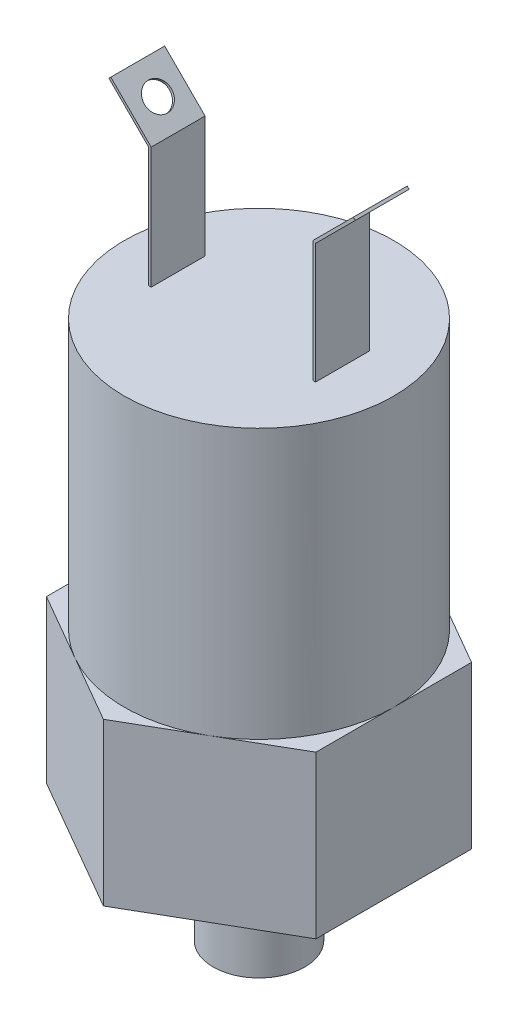
ISO-10303-21;
HEADER;
FILE_DESCRIPTION(('STEP AP214'),'2;1');
FILE_NAME('part.step','',(''),(''),'','','');
FILE_SCHEMA(('AUTOMOTIVE_DESIGN { 1 0 10303 214 1 1 1 1 }'));
ENDSEC;
DATA;
#1=APPLICATION_CONTEXT('core data for automotive mechanical design processes');
#2=APPLICATION_PROTOCOL_DEFINITION('international standard','automotive_design',2000,#1);
#3=PRODUCT_CONTEXT('',#1,'mechanical');
#4=PRODUCT('Part','Part','',(#3));
#5=PRODUCT_RELATED_PRODUCT_CATEGORY('part','',(#4));
#6=PRODUCT_DEFINITION_FORMATION('','',#4);
#7=PRODUCT_DEFINITION_CONTEXT('part definition',#1,'design');
#8=PRODUCT_DEFINITION('design','',#6,#7);
#9=PRODUCT_DEFINITION_SHAPE('','',#8);
#10=(LENGTH_UNIT() NAMED_UNIT(*) SI_UNIT(.MILLI.,.METRE.));
#11=(NAMED_UNIT(*) PLANE_ANGLE_UNIT() SI_UNIT($,.RADIAN.));
#12=(NAMED_UNIT(*) SI_UNIT($,.STERADIAN.) SOLID_ANGLE_UNIT());
#13=UNCERTAINTY_MEASURE_WITH_UNIT(LENGTH_MEASURE(1.E-05),#10,'distance_accuracy_value','');
#14=(GEOMETRIC_REPRESENTATION_CONTEXT(3) GLOBAL_UNCERTAINTY_ASSIGNED_CONTEXT((#13)) GLOBAL_UNIT_ASSIGNED_CONTEXT((#10,
#11,#12)) REPRESENTATION_CONTEXT('',''));
#15=CARTESIAN_POINT('',(0.,0.,0.));
#16=DIRECTION('',(0.,0.,1.));
#17=DIRECTION('',(1.,0.,0.));
#18=AXIS2_PLACEMENT_3D('',#15,#16,#17);
#19=CARTESIAN_POINT('',(0.,50.8,0.));
#20=DIRECTION('',(0.,1.,0.));
#21=DIRECTION('',(0.,0.,1.));
#22=AXIS2_PLACEMENT_3D('',#19,#20,#21);
#23=PLANE('',#22);
#24=CARTESIAN_POINT('',(0.,50.8,0.));
#25=DIRECTION('',(0.,1.,0.));
#26=DIRECTION('',(0.,0.,1.));
#27=AXIS2_PLACEMENT_3D('',#24,#25,#26);
#28=CIRCLE('',#27,12.7);
#29=CARTESIAN_POINT('',(0.,50.8,12.7));
#30=VERTEX_POINT('',#29);
#31=EDGE_CURVE('E283',#30,#30,#28,.T.);
#32=ORIENTED_EDGE('',*,*,#31,.T.);
#33=EDGE_LOOP('',(#32));
#34=FACE_BOUND('',#33,.T.);
#35=DIRECTION('',(0.,0.,-1.));
#36=VECTOR('',#35,1.);
#37=CARTESIAN_POINT('',(7.874,50.8,2.54));
#38=LINE('',#37,#36);
#39=CARTESIAN_POINT('',(7.874,50.8,2.54));
#40=VERTEX_POINT('',#39);
#41=CARTESIAN_POINT('',(7.874,50.8,-2.54));
#42=VERTEX_POINT('',#41);
#43=EDGE_CURVE('E272',#40,#42,#38,.T.);
#44=ORIENTED_EDGE('',*,*,#43,.F.);
#45=DIRECTION('',(-1.,0.,0.));
#46=VECTOR('',#45,1.);
#47=CARTESIAN_POINT('',(7.874,50.8,2.54));
#48=LINE('',#47,#46);
#49=CARTESIAN_POINT('',(7.62,50.8,2.54));
#50=VERTEX_POINT('',#49);
#51=EDGE_CURVE('E250',#40,#50,#48,.T.);
#52=ORIENTED_EDGE('',*,*,#51,.T.);
#53=DIRECTION('',(0.,0.,-1.));
#54=VECTOR('',#53,1.);
#55=CARTESIAN_POINT('',(7.62,50.8,2.54));
#56=LINE('',#55,#54);
#57=CARTESIAN_POINT('',(7.62,50.8,-2.54));
#58=VERTEX_POINT('',#57);
#59=EDGE_CURVE('E275',#50,#58,#56,.T.);
#60=ORIENTED_EDGE('',*,*,#59,.T.);
#61=DIRECTION('',(-1.,0.,0.));
#62=VECTOR('',#61,1.);
#63=CARTESIAN_POINT('',(7.874,50.8,-2.54));
#64=LINE('',#63,#62);
#65=EDGE_CURVE('E266',#42,#58,#64,.T.);
#66=ORIENTED_EDGE('',*,*,#65,.F.);
#67=EDGE_LOOP('',(#44,#52,#60,#66));
#68=FACE_BOUND('',#67,.T.);
#69=DIRECTION('',(0.,0.,-1.));
#70=VECTOR('',#69,1.);
#71=CARTESIAN_POINT('',(-7.62,50.8,2.54));
#72=LINE('',#71,#70);
#73=CARTESIAN_POINT('',(-7.62,50.8,2.54));
#74=VERTEX_POINT('',#73);
#75=CARTESIAN_POINT('',(-7.62,50.8,-2.54));
#76=VERTEX_POINT('',#75);
#77=EDGE_CURVE('E57',#74,#76,#72,.T.);
#78=ORIENTED_EDGE('',*,*,#77,.F.);
#79=DIRECTION('',(1.,0.,0.));
#80=VECTOR('',#79,1.);
#81=CARTESIAN_POINT('',(-7.874,50.8,2.54));
#82=LINE('',#81,#80);
#83=CARTESIAN_POINT('',(-7.874,50.8,2.54));
#84=VERTEX_POINT('',#83);
#85=EDGE_CURVE('E52',#84,#74,#82,.T.);
#86=ORIENTED_EDGE('',*,*,#85,.F.);
#87=DIRECTION('',(0.,0.,-1.));
#88=VECTOR('',#87,1.);
#89=CARTESIAN_POINT('',(-7.874,50.8,2.54));
#90=LINE('',#89,#88);
#91=CARTESIAN_POINT('',(-7.874,50.8,-2.54));
#92=VERTEX_POINT('',#91);
#93=EDGE_CURVE('E189',#84,#92,#90,.T.);
#94=ORIENTED_EDGE('',*,*,#93,.T.);
#95=DIRECTION('',(1.,0.,0.));
#96=VECTOR('',#95,1.);
#97=CARTESIAN_POINT('',(-7.874,50.8,-2.54));
#98=LINE('',#97,#96);
#99=EDGE_CURVE('E215',#92,#76,#98,.T.);
#100=ORIENTED_EDGE('',*,*,#99,.T.);
#101=EDGE_LOOP('',(#78,#86,#94,#100));
#102=FACE_BOUND('',#101,.T.);
#103=ADVANCED_FACE('F34',(#34,#68,#102),#23,.T.);
#104=CARTESIAN_POINT('',(0.,25.4,0.));
#105=DIRECTION('',(0.,1.,0.));
#106=DIRECTION('',(0.,0.,1.));
#107=AXIS2_PLACEMENT_3D('',#104,#105,#106);
#108=PLANE('',#107);
#109=CARTESIAN_POINT('',(0.,25.4,0.));
#110=DIRECTION('',(0.,1.,0.));
#111=DIRECTION('',(0.,0.,1.));
#112=AXIS2_PLACEMENT_3D('',#109,#110,#111);
#113=CIRCLE('',#112,12.7);
#114=CARTESIAN_POINT('',(6.35,25.4,10.9985226280624));
#115=VERTEX_POINT('',#114);
#116=CARTESIAN_POINT('',(12.7,25.4,0.));
#117=VERTEX_POINT('',#116);
#118=EDGE_CURVE('E45',#115,#117,#113,.T.);
#119=ORIENTED_EDGE('',*,*,#118,.F.);
#120=DIRECTION('',(0.866025403784439,0.,-0.5));
#121=VECTOR('',#120,1.);
#122=CARTESIAN_POINT('',(0.,25.4,14.6646968374165));
#123=LINE('',#122,#121);
#124=CARTESIAN_POINT('',(12.7,25.4,7.33234841870824));
#125=VERTEX_POINT('',#124);
#126=EDGE_CURVE('E305',#115,#125,#123,.T.);
#127=ORIENTED_EDGE('',*,*,#126,.T.);
#128=DIRECTION('',(0.,0.,-1.));
#129=VECTOR('',#128,1.);
#130=CARTESIAN_POINT('',(12.7,25.4,7.33234841870824));
#131=LINE('',#130,#129);
#132=EDGE_CURVE('E309',#125,#117,#131,.T.);
#133=ORIENTED_EDGE('',*,*,#132,.T.);
#134=EDGE_LOOP('',(#119,#127,#133));
#135=FACE_BOUND('',#134,.T.);
#136=ADVANCED_FACE('F364',(#135),#108,.T.);
#137=CARTESIAN_POINT('',(6.35,25.4,-10.9985226280624));
#138=VERTEX_POINT('',#137);
#139=EDGE_CURVE('E11',#117,#138,#113,.T.);
#140=ORIENTED_EDGE('',*,*,#139,.F.);
#141=CARTESIAN_POINT('',(12.7,25.4,-7.33234841870825));
#142=VERTEX_POINT('',#141);
#143=EDGE_CURVE('E308',#117,#142,#131,.T.);
#144=ORIENTED_EDGE('',*,*,#143,.T.);
#145=DIRECTION('',(-0.866025403784439,0.,-0.5));
#146=VECTOR('',#145,1.);
#147=CARTESIAN_POINT('',(12.7,25.4,-7.33234841870825));
#148=LINE('',#147,#146);
#149=EDGE_CURVE('E289',#142,#138,#148,.T.);
#150=ORIENTED_EDGE('',*,*,#149,.T.);
#151=EDGE_LOOP('',(#140,#144,#150));
#152=FACE_BOUND('',#151,.T.);
#153=ADVANCED_FACE('F370',(#152),#108,.T.);
#154=CARTESIAN_POINT('',(-6.35,25.4,-10.9985226280624));
#155=VERTEX_POINT('',#154);
#156=EDGE_CURVE('E43',#138,#155,#113,.T.);
#157=ORIENTED_EDGE('',*,*,#156,.F.);
#158=CARTESIAN_POINT('',(0.,25.4,-14.6646968374165));
#159=VERTEX_POINT('',#158);
#160=EDGE_CURVE('E293',#138,#159,#148,.T.);
#161=ORIENTED_EDGE('',*,*,#160,.T.);
#162=DIRECTION('',(-0.866025403784438,0.,0.5));
#163=VECTOR('',#162,1.);
#164=CARTESIAN_POINT('',(0.,25.4,-14.6646968374165));
#165=LINE('',#164,#163);
#166=EDGE_CURVE('E294',#159,#155,#165,.T.);
#167=ORIENTED_EDGE('',*,*,#166,.T.);
#168=EDGE_LOOP('',(#157,#161,#167));
#169=FACE_BOUND('',#168,.T.);
#170=ADVANCED_FACE('F436',(#169),#108,.T.);
#171=CARTESIAN_POINT('',(-12.7,25.4,0.));
#172=VERTEX_POINT('',#171);
#173=EDGE_CURVE('E433',#155,#172,#113,.T.);
#174=ORIENTED_EDGE('',*,*,#173,.F.);
#175=CARTESIAN_POINT('',(-12.7,25.4,-7.33234841870824));
#176=VERTEX_POINT('',#175);
#177=EDGE_CURVE('E292',#155,#176,#165,.T.);
#178=ORIENTED_EDGE('',*,*,#177,.T.);
#179=DIRECTION('',(0.,0.,1.));
#180=VECTOR('',#179,1.);
#181=CARTESIAN_POINT('',(-12.7,25.4,-7.33234841870824));
#182=LINE('',#181,#180);
#183=EDGE_CURVE('E298',#176,#172,#182,.T.);
#184=ORIENTED_EDGE('',*,*,#183,.T.);
#185=EDGE_LOOP('',(#174,#178,#184));
#186=FACE_BOUND('',#185,.T.);
#187=ADVANCED_FACE('F446',(#186),#108,.T.);
#188=CARTESIAN_POINT('',(-6.35,25.4,10.9985226280624));
#189=VERTEX_POINT('',#188);
#190=EDGE_CURVE('E346',#172,#189,#113,.T.);
#191=ORIENTED_EDGE('',*,*,#190,.F.);
#192=CARTESIAN_POINT('',(-12.7,25.4,7.33234841870825));
#193=VERTEX_POINT('',#192);
#194=EDGE_CURVE('E297',#172,#193,#182,.T.);
#195=ORIENTED_EDGE('',*,*,#194,.T.);
#196=DIRECTION('',(0.866025403784439,0.,0.5));
#197=VECTOR('',#196,1.);
#198=CARTESIAN_POINT('',(-12.7,25.4,7.33234841870825));
#199=LINE('',#198,#197);
#200=EDGE_CURVE('E302',#193,#189,#199,.T.);
#201=ORIENTED_EDGE('',*,*,#200,.T.);
#202=EDGE_LOOP('',(#191,#195,#201));
#203=FACE_BOUND('',#202,.T.);
#204=ADVANCED_FACE('F361',(#203),#108,.T.);
#205=CARTESIAN_POINT('',(0.,10.16,0.));
#206=DIRECTION('',(0.,-1.,0.));
#207=DIRECTION('',(0.,0.,-1.));
#208=AXIS2_PLACEMENT_3D('',#205,#206,#207);
#209=CYLINDRICAL_SURFACE('',#208,4.318);
#210=CARTESIAN_POINT('',(0.,10.16,0.));
#211=DIRECTION('',(0.,1.,0.));
#212=DIRECTION('',(0.,0.,1.));
#213=AXIS2_PLACEMENT_3D('',#210,#211,#212);
#214=CIRCLE('',#213,4.318);
#215=CARTESIAN_POINT('',(0.,10.16,4.318));
#216=VERTEX_POINT('',#215);
#217=EDGE_CURVE('E341',#216,#216,#214,.T.);
#218=ORIENTED_EDGE('',*,*,#217,.F.);
#219=EDGE_LOOP('',(#218));
#220=FACE_BOUND('',#219,.T.);
#221=CARTESIAN_POINT('',(0.,0.,0.));
#222=DIRECTION('',(0.,1.,0.));
#223=DIRECTION('',(0.,0.,1.));
#224=AXIS2_PLACEMENT_3D('',#221,#222,#223);
#225=CIRCLE('',#224,4.318);
#226=CARTESIAN_POINT('',(0.,0.,4.318));
#227=VERTEX_POINT('',#226);
#228=EDGE_CURVE('E38',#227,#227,#225,.T.);
#229=ORIENTED_EDGE('',*,*,#228,.T.);
#230=EDGE_LOOP('',(#229));
#231=FACE_BOUND('',#230,.T.);
#232=ADVANCED_FACE('F36',(#220,#231),#209,.T.);
#233=CARTESIAN_POINT('',(0.,0.,0.));
#234=DIRECTION('',(0.,1.,0.));
#235=DIRECTION('',(0.,0.,1.));
#236=AXIS2_PLACEMENT_3D('',#233,#234,#235);
#237=PLANE('',#236);
#238=ORIENTED_EDGE('',*,*,#228,.F.);
#239=EDGE_LOOP('',(#238));
#240=FACE_BOUND('',#239,.T.);
#241=ADVANCED_FACE('F351',(#240),#237,.F.);
#242=CARTESIAN_POINT('',(12.7,25.4,-7.33234841870825));
#243=DIRECTION('',(-0.5,0.,0.866025403784439));
#244=DIRECTION('',(0.866025403784439,0.,0.5));
#245=AXIS2_PLACEMENT_3D('',#242,#243,#244);
#246=PLANE('',#245);
#247=DIRECTION('',(-0.866025403784439,0.,-0.5));
#248=VECTOR('',#247,1.);
#249=CARTESIAN_POINT('',(12.7,10.16,-7.33234841870825));
#250=LINE('',#249,#248);
#251=CARTESIAN_POINT('',(12.7,10.16,-7.33234841870825));
#252=VERTEX_POINT('',#251);
#253=CARTESIAN_POINT('',(0.,10.16,-14.6646968374165));
#254=VERTEX_POINT('',#253);
#255=EDGE_CURVE('E285',#252,#254,#250,.T.);
#256=ORIENTED_EDGE('',*,*,#255,.T.);
#257=DIRECTION('',(0.,-1.,0.));
#258=VECTOR('',#257,1.);
#259=CARTESIAN_POINT('',(0.,25.4,-14.6646968374165));
#260=LINE('',#259,#258);
#261=EDGE_CURVE('E339',#159,#254,#260,.T.);
#262=ORIENTED_EDGE('',*,*,#261,.F.);
#263=ORIENTED_EDGE('',*,*,#160,.F.);
#264=ORIENTED_EDGE('',*,*,#149,.F.);
#265=DIRECTION('',(0.,-1.,0.));
#266=VECTOR('',#265,1.);
#267=CARTESIAN_POINT('',(12.7,25.4,-7.33234841870825));
#268=LINE('',#267,#266);
#269=EDGE_CURVE('E312',#142,#252,#268,.T.);
#270=ORIENTED_EDGE('',*,*,#269,.T.);
#271=EDGE_LOOP('',(#256,#262,#263,#264,#270));
#272=FACE_BOUND('',#271,.T.);
#273=ADVANCED_FACE('F353',(#272),#246,.F.);
#274=CARTESIAN_POINT('',(0.,25.4,-14.6646968374165));
#275=DIRECTION('',(0.5,0.,0.866025403784438));
#276=DIRECTION('',(0.866025403784439,0.,-0.5));
#277=AXIS2_PLACEMENT_3D('',#274,#275,#276);
#278=PLANE('',#277);
#279=DIRECTION('',(-0.866025403784438,0.,0.5));
#280=VECTOR('',#279,1.);
#281=CARTESIAN_POINT('',(0.,10.16,-14.6646968374165));
#282=LINE('',#281,#280);
#283=CARTESIAN_POINT('',(-12.7,10.16,-7.33234841870824));
#284=VERTEX_POINT('',#283);
#285=EDGE_CURVE('E315',#254,#284,#282,.T.);
#286=ORIENTED_EDGE('',*,*,#285,.T.);
#287=DIRECTION('',(0.,-1.,0.));
#288=VECTOR('',#287,1.);
#289=CARTESIAN_POINT('',(-12.7,25.4,-7.33234841870824));
#290=LINE('',#289,#288);
#291=EDGE_CURVE('E336',#176,#284,#290,.T.);
#292=ORIENTED_EDGE('',*,*,#291,.F.);
#293=ORIENTED_EDGE('',*,*,#177,.F.);
#294=ORIENTED_EDGE('',*,*,#166,.F.);
#295=ORIENTED_EDGE('',*,*,#261,.T.);
#296=EDGE_LOOP('',(#286,#292,#293,#294,#295));
#297=FACE_BOUND('',#296,.T.);
#298=ADVANCED_FACE('F358',(#297),#278,.F.);
#299=CARTESIAN_POINT('',(-12.7,25.4,-7.33234841870824));
#300=DIRECTION('',(1.,0.,0.));
#301=DIRECTION('',(0.,0.,-1.));
#302=AXIS2_PLACEMENT_3D('',#299,#300,#301);
#303=PLANE('',#302);
#304=DIRECTION('',(0.,0.,1.));
#305=VECTOR('',#304,1.);
#306=CARTESIAN_POINT('',(-12.7,10.16,-7.33234841870824));
#307=LINE('',#306,#305);
#308=CARTESIAN_POINT('',(-12.7,10.16,7.33234841870825));
#309=VERTEX_POINT('',#308);
#310=EDGE_CURVE('E317',#284,#309,#307,.T.);
#311=ORIENTED_EDGE('',*,*,#310,.T.);
#312=DIRECTION('',(0.,-1.,0.));
#313=VECTOR('',#312,1.);
#314=CARTESIAN_POINT('',(-12.7,25.4,7.33234841870825));
#315=LINE('',#314,#313);
#316=EDGE_CURVE('E333',#193,#309,#315,.T.);
#317=ORIENTED_EDGE('',*,*,#316,.F.);
#318=ORIENTED_EDGE('',*,*,#194,.F.);
#319=ORIENTED_EDGE('',*,*,#183,.F.);
#320=ORIENTED_EDGE('',*,*,#291,.T.);
#321=EDGE_LOOP('',(#311,#317,#318,#319,#320));
#322=FACE_BOUND('',#321,.T.);
#323=ADVANCED_FACE('F399',(#322),#303,.F.);
#324=CARTESIAN_POINT('',(-12.7,25.4,7.33234841870825));
#325=DIRECTION('',(0.5,0.,-0.866025403784439));
#326=DIRECTION('',(-0.866025403784439,0.,-0.5));
#327=AXIS2_PLACEMENT_3D('',#324,#325,#326);
#328=PLANE('',#327);
#329=DIRECTION('',(0.866025403784439,0.,0.5));
#330=VECTOR('',#329,1.);
#331=CARTESIAN_POINT('',(-12.7,10.16,7.33234841870825));
#332=LINE('',#331,#330);
#333=CARTESIAN_POINT('',(0.,10.16,14.6646968374165));
#334=VERTEX_POINT('',#333);
#335=EDGE_CURVE('E319',#309,#334,#332,.T.);
#336=ORIENTED_EDGE('',*,*,#335,.T.);
#337=DIRECTION('',(0.,-1.,0.));
#338=VECTOR('',#337,1.);
#339=CARTESIAN_POINT('',(0.,25.4,14.6646968374165));
#340=LINE('',#339,#338);
#341=CARTESIAN_POINT('',(0.,25.4,14.6646968374165));
#342=VERTEX_POINT('',#341);
#343=EDGE_CURVE('E330',#342,#334,#340,.T.);
#344=ORIENTED_EDGE('',*,*,#343,.F.);
#345=EDGE_CURVE('E301',#189,#342,#199,.T.);
#346=ORIENTED_EDGE('',*,*,#345,.F.);
#347=ORIENTED_EDGE('',*,*,#200,.F.);
#348=ORIENTED_EDGE('',*,*,#316,.T.);
#349=EDGE_LOOP('',(#336,#344,#346,#347,#348));
#350=FACE_BOUND('',#349,.T.);
#351=ADVANCED_FACE('F395',(#350),#328,.F.);
#352=CARTESIAN_POINT('',(0.,25.4,14.6646968374165));
#353=DIRECTION('',(-0.5,0.,-0.866025403784439));
#354=DIRECTION('',(-0.866025403784439,0.,0.5));
#355=AXIS2_PLACEMENT_3D('',#352,#353,#354);
#356=PLANE('',#355);
#357=DIRECTION('',(0.866025403784439,0.,-0.5));
#358=VECTOR('',#357,1.);
#359=CARTESIAN_POINT('',(0.,10.16,14.6646968374165));
#360=LINE('',#359,#358);
#361=CARTESIAN_POINT('',(12.7,10.16,7.33234841870824));
#362=VERTEX_POINT('',#361);
#363=EDGE_CURVE('E321',#334,#362,#360,.T.);
#364=ORIENTED_EDGE('',*,*,#363,.T.);
#365=DIRECTION('',(0.,-1.,0.));
#366=VECTOR('',#365,1.);
#367=CARTESIAN_POINT('',(12.7,25.4,7.33234841870824));
#368=LINE('',#367,#366);
#369=EDGE_CURVE('E327',#125,#362,#368,.T.);
#370=ORIENTED_EDGE('',*,*,#369,.F.);
#371=ORIENTED_EDGE('',*,*,#126,.F.);
#372=EDGE_CURVE('E306',#342,#115,#123,.T.);
#373=ORIENTED_EDGE('',*,*,#372,.F.);
#374=ORIENTED_EDGE('',*,*,#343,.T.);
#375=EDGE_LOOP('',(#364,#370,#371,#373,#374));
#376=FACE_BOUND('',#375,.T.);
#377=ADVANCED_FACE('F391',(#376),#356,.F.);
#378=CARTESIAN_POINT('',(12.7,25.4,7.33234841870824));
#379=DIRECTION('',(-1.,0.,0.));
#380=DIRECTION('',(0.,0.,1.));
#381=AXIS2_PLACEMENT_3D('',#378,#379,#380);
#382=PLANE('',#381);
#383=DIRECTION('',(0.,0.,-1.));
#384=VECTOR('',#383,1.);
#385=CARTESIAN_POINT('',(12.7,10.16,7.33234841870824));
#386=LINE('',#385,#384);
#387=EDGE_CURVE('E323',#362,#252,#386,.T.);
#388=ORIENTED_EDGE('',*,*,#387,.T.);
#389=ORIENTED_EDGE('',*,*,#269,.F.);
#390=ORIENTED_EDGE('',*,*,#143,.F.);
#391=ORIENTED_EDGE('',*,*,#132,.F.);
#392=ORIENTED_EDGE('',*,*,#369,.T.);
#393=EDGE_LOOP('',(#388,#389,#390,#391,#392));
#394=FACE_BOUND('',#393,.T.);
#395=ADVANCED_FACE('F385',(#394),#382,.F.);
#396=EDGE_CURVE('E288',#189,#115,#113,.T.);
#397=ORIENTED_EDGE('',*,*,#396,.F.);
#398=ORIENTED_EDGE('',*,*,#345,.T.);
#399=ORIENTED_EDGE('',*,*,#372,.T.);
#400=EDGE_LOOP('',(#397,#398,#399));
#401=FACE_BOUND('',#400,.T.);
#402=ADVANCED_FACE('F373',(#401),#108,.T.);
#403=CARTESIAN_POINT('',(0.,10.16,0.));
#404=DIRECTION('',(0.,1.,0.));
#405=DIRECTION('',(0.,0.,1.));
#406=AXIS2_PLACEMENT_3D('',#403,#404,#405);
#407=PLANE('',#406);
#408=ORIENTED_EDGE('',*,*,#217,.T.);
#409=EDGE_LOOP('',(#408));
#410=FACE_BOUND('',#409,.T.);
#411=ORIENTED_EDGE('',*,*,#255,.F.);
#412=ORIENTED_EDGE('',*,*,#387,.F.);
#413=ORIENTED_EDGE('',*,*,#363,.F.);
#414=ORIENTED_EDGE('',*,*,#335,.F.);
#415=ORIENTED_EDGE('',*,*,#310,.F.);
#416=ORIENTED_EDGE('',*,*,#285,.F.);
#417=EDGE_LOOP('',(#411,#412,#413,#414,#415,#416));
#418=FACE_BOUND('',#417,.T.);
#419=ADVANCED_FACE('F381',(#410,#418),#407,.F.);
#420=CARTESIAN_POINT('',(0.,50.8,0.));
#421=DIRECTION('',(0.,-1.,0.));
#422=DIRECTION('',(0.,0.,-1.));
#423=AXIS2_PLACEMENT_3D('',#420,#421,#422);
#424=CYLINDRICAL_SURFACE('',#423,12.7);
#425=ORIENTED_EDGE('',*,*,#31,.F.);
#426=EDGE_LOOP('',(#425));
#427=FACE_BOUND('',#426,.T.);
#428=ORIENTED_EDGE('',*,*,#118,.T.);
#429=ORIENTED_EDGE('',*,*,#139,.T.);
#430=ORIENTED_EDGE('',*,*,#156,.T.);
#431=ORIENTED_EDGE('',*,*,#173,.T.);
#432=ORIENTED_EDGE('',*,*,#190,.T.);
#433=ORIENTED_EDGE('',*,*,#396,.T.);
#434=EDGE_LOOP('',(#428,#429,#430,#431,#432,#433));
#435=FACE_BOUND('',#434,.T.);
#436=ADVANCED_FACE('F379',(#427,#435),#424,.T.);
#437=CARTESIAN_POINT('',(7.79960512242138,62.0503948775786,2.54));
#438=DIRECTION('',(-0.707106781186545,0.70710678118655,0.));
#439=DIRECTION('',(-0.70710678118655,-0.707106781186545,0.));
#440=AXIS2_PLACEMENT_3D('',#437,#438,#439);
#441=PLANE('',#440);
#442=CARTESIAN_POINT('',(9.70460512242139,63.9553948775786,0.));
#443=DIRECTION('',(-0.707106781186545,0.70710678118655,0.));
#444=DIRECTION('',(-0.70710678118655,-0.707106781186545,0.));
#445=AXIS2_PLACEMENT_3D('',#442,#443,#444);
#446=CIRCLE('',#445,1.27);
#447=CARTESIAN_POINT('',(8.80657951031447,63.0573692654717,0.));
#448=VERTEX_POINT('',#447);
#449=EDGE_CURVE('E234',#448,#448,#446,.F.);
#450=ORIENTED_EDGE('',*,*,#449,.F.);
#451=EDGE_LOOP('',(#450));
#452=FACE_BOUND('',#451,.T.);
#453=DIRECTION('',(0.70710678118655,0.707106781186545,0.));
#454=VECTOR('',#453,1.);
#455=CARTESIAN_POINT('',(7.79960512242138,62.0503948775786,-2.54));
#456=LINE('',#455,#454);
#457=CARTESIAN_POINT('',(7.874,62.1247897551572,-2.54));
#458=VERTEX_POINT('',#457);
#459=CARTESIAN_POINT('',(11.6096051224214,65.8603948775786,-2.54));
#460=VERTEX_POINT('',#459);
#461=EDGE_CURVE('E237',#458,#460,#456,.T.);
#462=ORIENTED_EDGE('',*,*,#461,.T.);
#463=DIRECTION('',(0.,0.,-1.));
#464=VECTOR('',#463,1.);
#465=CARTESIAN_POINT('',(11.6096051224214,65.8603948775786,2.54));
#466=LINE('',#465,#464);
#467=CARTESIAN_POINT('',(11.6096051224214,65.8603948775786,2.54));
#468=VERTEX_POINT('',#467);
#469=EDGE_CURVE('E281',#468,#460,#466,.T.);
#470=ORIENTED_EDGE('',*,*,#469,.F.);
#471=DIRECTION('',(0.70710678118655,0.707106781186545,0.));
#472=VECTOR('',#471,1.);
#473=CARTESIAN_POINT('',(7.79960512242138,62.0503948775786,2.54));
#474=LINE('',#473,#472);
#475=CARTESIAN_POINT('',(7.874,62.1247897551572,2.54));
#476=VERTEX_POINT('',#475);
#477=EDGE_CURVE('E238',#476,#468,#474,.T.);
#478=ORIENTED_EDGE('',*,*,#477,.F.);
#479=DIRECTION('',(0.,0.,-1.));
#480=VECTOR('',#479,1.);
#481=CARTESIAN_POINT('',(7.874,62.1247897551572,2.54));
#482=LINE('',#481,#480);
#483=EDGE_CURVE('E254',#476,#458,#482,.T.);
#484=ORIENTED_EDGE('',*,*,#483,.T.);
#485=EDGE_LOOP('',(#462,#470,#478,#484));
#486=FACE_BOUND('',#485,.T.);
#487=ADVANCED_FACE('F377',(#452,#486),#441,.F.);
#488=CARTESIAN_POINT('',(11.43,66.04,2.54));
#489=DIRECTION('',(0.707106781186537,0.707106781186558,0.));
#490=DIRECTION('',(-0.707106781186558,0.707106781186537,0.));
#491=AXIS2_PLACEMENT_3D('',#488,#489,#490);
#492=PLANE('',#491);
#493=DIRECTION('',(0.707106781186558,-0.707106781186537,0.));
#494=VECTOR('',#493,1.);
#495=CARTESIAN_POINT('',(11.43,66.04,-2.54));
#496=LINE('',#495,#494);
#497=CARTESIAN_POINT('',(11.43,66.04,-2.54));
#498=VERTEX_POINT('',#497);
#499=EDGE_CURVE('E257',#498,#460,#496,.T.);
#500=ORIENTED_EDGE('',*,*,#499,.F.);
#501=DIRECTION('',(0.,0.,-1.));
#502=VECTOR('',#501,1.);
#503=CARTESIAN_POINT('',(11.43,66.04,2.54));
#504=LINE('',#503,#502);
#505=CARTESIAN_POINT('',(11.43,66.04,2.54));
#506=VERTEX_POINT('',#505);
#507=EDGE_CURVE('E279',#506,#498,#504,.T.);
#508=ORIENTED_EDGE('',*,*,#507,.F.);
#509=DIRECTION('',(0.707106781186558,-0.707106781186537,0.));
#510=VECTOR('',#509,1.);
#511=CARTESIAN_POINT('',(11.43,66.04,2.54));
#512=LINE('',#511,#510);
#513=EDGE_CURVE('E240',#506,#468,#512,.T.);
#514=ORIENTED_EDGE('',*,*,#513,.T.);
#515=ORIENTED_EDGE('',*,*,#469,.T.);
#516=EDGE_LOOP('',(#500,#508,#514,#515));
#517=FACE_BOUND('',#516,.T.);
#518=ADVANCED_FACE('F573',(#517),#492,.T.);
#519=CARTESIAN_POINT('',(7.62,62.23,2.54));
#520=DIRECTION('',(-0.707106781186545,0.70710678118655,0.));
#521=DIRECTION('',(-0.70710678118655,-0.707106781186545,0.));
#522=AXIS2_PLACEMENT_3D('',#519,#520,#521);
#523=PLANE('',#522);
#524=CARTESIAN_POINT('',(9.525,64.135,0.));
#525=DIRECTION('',(-0.707106781186545,0.70710678118655,0.));
#526=DIRECTION('',(-0.70710678118655,-0.707106781186545,0.));
#527=AXIS2_PLACEMENT_3D('',#524,#525,#526);
#528=CIRCLE('',#527,1.27);
#529=CARTESIAN_POINT('',(8.62697438789309,63.2369743878931,0.));
#530=VERTEX_POINT('',#529);
#531=EDGE_CURVE('E188',#530,#530,#528,.T.);
#532=ORIENTED_EDGE('',*,*,#531,.F.);
#533=EDGE_LOOP('',(#532));
#534=FACE_BOUND('',#533,.T.);
#535=DIRECTION('',(0.70710678118655,0.707106781186545,0.));
#536=VECTOR('',#535,1.);
#537=CARTESIAN_POINT('',(7.62,62.23,-2.54));
#538=LINE('',#537,#536);
#539=CARTESIAN_POINT('',(7.62,62.23,-2.54));
#540=VERTEX_POINT('',#539);
#541=EDGE_CURVE('E260',#540,#498,#538,.T.);
#542=ORIENTED_EDGE('',*,*,#541,.F.);
#543=DIRECTION('',(0.,0.,-1.));
#544=VECTOR('',#543,1.);
#545=CARTESIAN_POINT('',(7.62,62.23,2.54));
#546=LINE('',#545,#544);
#547=CARTESIAN_POINT('',(7.62,62.23,2.54));
#548=VERTEX_POINT('',#547);
#549=EDGE_CURVE('E277',#548,#540,#546,.T.);
#550=ORIENTED_EDGE('',*,*,#549,.F.);
#551=DIRECTION('',(0.70710678118655,0.707106781186545,0.));
#552=VECTOR('',#551,1.);
#553=CARTESIAN_POINT('',(7.62,62.23,2.54));
#554=LINE('',#553,#552);
#555=EDGE_CURVE('E244',#548,#506,#554,.T.);
#556=ORIENTED_EDGE('',*,*,#555,.T.);
#557=ORIENTED_EDGE('',*,*,#507,.T.);
#558=EDGE_LOOP('',(#542,#550,#556,#557));
#559=FACE_BOUND('',#558,.T.);
#560=ADVANCED_FACE('F570',(#534,#559),#523,.T.);
#561=CARTESIAN_POINT('',(7.62,50.8,2.54));
#562=DIRECTION('',(-1.,0.,0.));
#563=DIRECTION('',(0.,-1.,0.));
#564=AXIS2_PLACEMENT_3D('',#561,#562,#563);
#565=PLANE('',#564);
#566=DIRECTION('',(0.,1.,0.));
#567=VECTOR('',#566,1.);
#568=CARTESIAN_POINT('',(7.62,50.8,-2.54));
#569=LINE('',#568,#567);
#570=EDGE_CURVE('E263',#58,#540,#569,.T.);
#571=ORIENTED_EDGE('',*,*,#570,.F.);
#572=ORIENTED_EDGE('',*,*,#59,.F.);
#573=DIRECTION('',(0.,1.,0.));
#574=VECTOR('',#573,1.);
#575=CARTESIAN_POINT('',(7.62,50.8,2.54));
#576=LINE('',#575,#574);
#577=EDGE_CURVE('E247',#50,#548,#576,.T.);
#578=ORIENTED_EDGE('',*,*,#577,.T.);
#579=ORIENTED_EDGE('',*,*,#549,.T.);
#580=EDGE_LOOP('',(#571,#572,#578,#579));
#581=FACE_BOUND('',#580,.T.);
#582=ADVANCED_FACE('F566',(#581),#565,.T.);
#583=CARTESIAN_POINT('',(7.874,50.8,2.54));
#584=DIRECTION('',(-1.,0.,0.));
#585=DIRECTION('',(0.,-1.,0.));
#586=AXIS2_PLACEMENT_3D('',#583,#584,#585);
#587=PLANE('',#586);
#588=DIRECTION('',(0.,1.,0.));
#589=VECTOR('',#588,1.);
#590=CARTESIAN_POINT('',(7.874,50.8,-2.54));
#591=LINE('',#590,#589);
#592=EDGE_CURVE('E241',#42,#458,#591,.T.);
#593=ORIENTED_EDGE('',*,*,#592,.T.);
#594=ORIENTED_EDGE('',*,*,#483,.F.);
#595=DIRECTION('',(0.,1.,0.));
#596=VECTOR('',#595,1.);
#597=CARTESIAN_POINT('',(7.874,50.8,2.54));
#598=LINE('',#597,#596);
#599=EDGE_CURVE('E252',#40,#476,#598,.T.);
#600=ORIENTED_EDGE('',*,*,#599,.F.);
#601=ORIENTED_EDGE('',*,*,#43,.T.);
#602=EDGE_LOOP('',(#593,#594,#600,#601));
#603=FACE_BOUND('',#602,.T.);
#604=ADVANCED_FACE('F559',(#603),#587,.F.);
#605=CARTESIAN_POINT('',(0.,0.,2.54));
#606=DIRECTION('',(0.,0.,-1.));
#607=DIRECTION('',(-1.,0.,0.));
#608=AXIS2_PLACEMENT_3D('',#605,#606,#607);
#609=PLANE('',#608);
#610=ORIENTED_EDGE('',*,*,#477,.T.);
#611=ORIENTED_EDGE('',*,*,#513,.F.);
#612=ORIENTED_EDGE('',*,*,#555,.F.);
#613=ORIENTED_EDGE('',*,*,#577,.F.);
#614=ORIENTED_EDGE('',*,*,#51,.F.);
#615=ORIENTED_EDGE('',*,*,#599,.T.);
#616=EDGE_LOOP('',(#610,#611,#612,#613,#614,#615));
#617=FACE_BOUND('',#616,.T.);
#618=ADVANCED_FACE('F556',(#617),#609,.F.);
#619=CARTESIAN_POINT('',(0.,0.,-2.54));
#620=DIRECTION('',(0.,0.,-1.));
#621=DIRECTION('',(-1.,0.,0.));
#622=AXIS2_PLACEMENT_3D('',#619,#620,#621);
#623=PLANE('',#622);
#624=ORIENTED_EDGE('',*,*,#461,.F.);
#625=ORIENTED_EDGE('',*,*,#592,.F.);
#626=ORIENTED_EDGE('',*,*,#65,.T.);
#627=ORIENTED_EDGE('',*,*,#570,.T.);
#628=ORIENTED_EDGE('',*,*,#541,.T.);
#629=ORIENTED_EDGE('',*,*,#499,.T.);
#630=EDGE_LOOP('',(#624,#625,#626,#627,#628,#629));
#631=FACE_BOUND('',#630,.T.);
#632=ADVANCED_FACE('F554',(#631),#623,.T.);
#633=CARTESIAN_POINT('',(43.181,30.4789999999998,0.));
#634=DIRECTION('',(-0.707106781186545,0.70710678118655,0.));
#635=DIRECTION('',(-0.70710678118655,-0.707106781186545,0.));
#636=AXIS2_PLACEMENT_3D('',#633,#634,#635);
#637=CYLINDRICAL_SURFACE('',#636,1.27);
#638=ORIENTED_EDGE('',*,*,#531,.T.);
#639=EDGE_LOOP('',(#638));
#640=FACE_BOUND('',#639,.T.);
#641=ORIENTED_EDGE('',*,*,#449,.T.);
#642=EDGE_LOOP('',(#641));
#643=FACE_BOUND('',#642,.T.);
#644=ADVANCED_FACE('F494',(#640,#643),#637,.F.);
#645=CARTESIAN_POINT('',(-7.79960512242138,62.0503948775786,2.54));
#646=DIRECTION('',(-0.707106781186545,-0.70710678118655,0.));
#647=DIRECTION('',(0.70710678118655,-0.707106781186545,0.));
#648=AXIS2_PLACEMENT_3D('',#645,#646,#647);
#649=PLANE('',#648);
#650=CARTESIAN_POINT('',(-9.70460512242139,63.9553948775786,0.));
#651=DIRECTION('',(-0.707106781186545,-0.70710678118655,0.));
#652=DIRECTION('',(0.70710678118655,-0.707106781186545,0.));
#653=AXIS2_PLACEMENT_3D('',#650,#651,#652);
#654=CIRCLE('',#653,1.27);
#655=CARTESIAN_POINT('',(-8.80657951031447,63.0573692654717,0.));
#656=VERTEX_POINT('',#655);
#657=EDGE_CURVE('E213',#656,#656,#654,.T.);
#658=ORIENTED_EDGE('',*,*,#657,.F.);
#659=EDGE_LOOP('',(#658));
#660=FACE_BOUND('',#659,.T.);
#661=DIRECTION('',(-0.70710678118655,0.707106781186545,0.));
#662=VECTOR('',#661,1.);
#663=CARTESIAN_POINT('',(-7.79960512242138,62.0503948775786,-2.54));
#664=LINE('',#663,#662);
#665=CARTESIAN_POINT('',(-7.874,62.1247897551572,-2.54));
#666=VERTEX_POINT('',#665);
#667=CARTESIAN_POINT('',(-11.6096051224214,65.8603948775786,-2.54));
#668=VERTEX_POINT('',#667);
#669=EDGE_CURVE('E183',#666,#668,#664,.T.);
#670=ORIENTED_EDGE('',*,*,#669,.F.);
#671=DIRECTION('',(0.,0.,-1.));
#672=VECTOR('',#671,1.);
#673=CARTESIAN_POINT('',(-7.874,62.1247897551572,2.54));
#674=LINE('',#673,#672);
#675=CARTESIAN_POINT('',(-7.874,62.1247897551572,2.54));
#676=VERTEX_POINT('',#675);
#677=EDGE_CURVE('E178',#676,#666,#674,.T.);
#678=ORIENTED_EDGE('',*,*,#677,.F.);
#679=DIRECTION('',(-0.70710678118655,0.707106781186545,0.));
#680=VECTOR('',#679,1.);
#681=CARTESIAN_POINT('',(-7.79960512242138,62.0503948775786,2.54));
#682=LINE('',#681,#680);
#683=CARTESIAN_POINT('',(-11.6096051224214,65.8603948775786,2.54));
#684=VERTEX_POINT('',#683);
#685=EDGE_CURVE('E181',#676,#684,#682,.T.);
#686=ORIENTED_EDGE('',*,*,#685,.T.);
#687=DIRECTION('',(0.,0.,-1.));
#688=VECTOR('',#687,1.);
#689=CARTESIAN_POINT('',(-11.6096051224214,65.8603948775786,2.54));
#690=LINE('',#689,#688);
#691=EDGE_CURVE('E210',#684,#668,#690,.T.);
#692=ORIENTED_EDGE('',*,*,#691,.T.);
#693=EDGE_LOOP('',(#670,#678,#686,#692));
#694=FACE_BOUND('',#693,.T.);
#695=ADVANCED_FACE('F180',(#660,#694),#649,.T.);
#696=CARTESIAN_POINT('',(-7.874,50.8,2.54));
#697=DIRECTION('',(-1.,0.,0.));
#698=DIRECTION('',(0.,-1.,0.));
#699=AXIS2_PLACEMENT_3D('',#696,#697,#698);
#700=PLANE('',#699);
#701=DIRECTION('',(0.,1.,0.));
#702=VECTOR('',#701,1.);
#703=CARTESIAN_POINT('',(-7.874,50.8,-2.54));
#704=LINE('',#703,#702);
#705=EDGE_CURVE('E212',#92,#666,#704,.T.);
#706=ORIENTED_EDGE('',*,*,#705,.F.);
#707=ORIENTED_EDGE('',*,*,#93,.F.);
#708=DIRECTION('',(0.,1.,0.));
#709=VECTOR('',#708,1.);
#710=CARTESIAN_POINT('',(-7.874,50.8,2.54));
#711=LINE('',#710,#709);
#712=EDGE_CURVE('E194',#84,#676,#711,.T.);
#713=ORIENTED_EDGE('',*,*,#712,.T.);
#714=ORIENTED_EDGE('',*,*,#677,.T.);
#715=EDGE_LOOP('',(#706,#707,#713,#714));
#716=FACE_BOUND('',#715,.T.);
#717=ADVANCED_FACE('F200',(#716),#700,.T.);
#718=CARTESIAN_POINT('',(-7.62,50.8,2.54));
#719=DIRECTION('',(-1.,0.,0.));
#720=DIRECTION('',(0.,-1.,0.));
#721=AXIS2_PLACEMENT_3D('',#718,#719,#720);
#722=PLANE('',#721);
#723=DIRECTION('',(0.,1.,0.));
#724=VECTOR('',#723,1.);
#725=CARTESIAN_POINT('',(-7.62,50.8,-2.54));
#726=LINE('',#725,#724);
#727=CARTESIAN_POINT('',(-7.62,62.23,-2.54));
#728=VERTEX_POINT('',#727);
#729=EDGE_CURVE('E217',#76,#728,#726,.T.);
#730=ORIENTED_EDGE('',*,*,#729,.T.);
#731=DIRECTION('',(0.,0.,-1.));
#732=VECTOR('',#731,1.);
#733=CARTESIAN_POINT('',(-7.62,62.23,2.54));
#734=LINE('',#733,#732);
#735=CARTESIAN_POINT('',(-7.62,62.23,2.54));
#736=VERTEX_POINT('',#735);
#737=EDGE_CURVE('E227',#736,#728,#734,.T.);
#738=ORIENTED_EDGE('',*,*,#737,.F.);
#739=DIRECTION('',(0.,1.,0.));
#740=VECTOR('',#739,1.);
#741=CARTESIAN_POINT('',(-7.62,50.8,2.54));
#742=LINE('',#741,#740);
#743=EDGE_CURVE('E202',#74,#736,#742,.T.);
#744=ORIENTED_EDGE('',*,*,#743,.F.);
#745=ORIENTED_EDGE('',*,*,#77,.T.);
#746=EDGE_LOOP('',(#730,#738,#744,#745));
#747=FACE_BOUND('',#746,.T.);
#748=ADVANCED_FACE('F505',(#747),#722,.F.);
#749=CARTESIAN_POINT('',(-7.62,62.23,2.54));
#750=DIRECTION('',(-0.707106781186545,-0.70710678118655,0.));
#751=DIRECTION('',(0.70710678118655,-0.707106781186545,0.));
#752=AXIS2_PLACEMENT_3D('',#749,#750,#751);
#753=PLANE('',#752);
#754=CARTESIAN_POINT('',(-9.525,64.135,0.));
#755=DIRECTION('',(-0.707106781186545,-0.70710678118655,0.));
#756=DIRECTION('',(0.70710678118655,-0.707106781186545,0.));
#757=AXIS2_PLACEMENT_3D('',#754,#755,#756);
#758=CIRCLE('',#757,1.27);
#759=CARTESIAN_POINT('',(-8.62697438789309,63.2369743878931,0.));
#760=VERTEX_POINT('',#759);
#761=EDGE_CURVE('E736',#760,#760,#758,.T.);
#762=ORIENTED_EDGE('',*,*,#761,.T.);
#763=EDGE_LOOP('',(#762));
#764=FACE_BOUND('',#763,.T.);
#765=DIRECTION('',(-0.70710678118655,0.707106781186545,0.));
#766=VECTOR('',#765,1.);
#767=CARTESIAN_POINT('',(-7.62,62.23,-2.54));
#768=LINE('',#767,#766);
#769=CARTESIAN_POINT('',(-11.43,66.04,-2.54));
#770=VERTEX_POINT('',#769);
#771=EDGE_CURVE('E219',#728,#770,#768,.T.);
#772=ORIENTED_EDGE('',*,*,#771,.T.);
#773=DIRECTION('',(0.,0.,-1.));
#774=VECTOR('',#773,1.);
#775=CARTESIAN_POINT('',(-11.43,66.04,2.54));
#776=LINE('',#775,#774);
#777=CARTESIAN_POINT('',(-11.43,66.04,2.54));
#778=VERTEX_POINT('',#777);
#779=EDGE_CURVE('E224',#778,#770,#776,.T.);
#780=ORIENTED_EDGE('',*,*,#779,.F.);
#781=DIRECTION('',(-0.70710678118655,0.707106781186545,0.));
#782=VECTOR('',#781,1.);
#783=CARTESIAN_POINT('',(-7.62,62.23,2.54));
#784=LINE('',#783,#782);
#785=EDGE_CURVE('E207',#736,#778,#784,.T.);
#786=ORIENTED_EDGE('',*,*,#785,.F.);
#787=ORIENTED_EDGE('',*,*,#737,.T.);
#788=EDGE_LOOP('',(#772,#780,#786,#787));
#789=FACE_BOUND('',#788,.T.);
#790=ADVANCED_FACE('F512',(#764,#789),#753,.F.);
#791=CARTESIAN_POINT('',(-11.43,66.04,2.54));
#792=DIRECTION('',(0.707106781186537,-0.707106781186558,0.));
#793=DIRECTION('',(0.707106781186558,0.707106781186537,0.));
#794=AXIS2_PLACEMENT_3D('',#791,#792,#793);
#795=PLANE('',#794);
#796=DIRECTION('',(-0.707106781186558,-0.707106781186537,0.));
#797=VECTOR('',#796,1.);
#798=CARTESIAN_POINT('',(-11.43,66.04,-2.54));
#799=LINE('',#798,#797);
#800=EDGE_CURVE('E198',#770,#668,#799,.T.);
#801=ORIENTED_EDGE('',*,*,#800,.T.);
#802=ORIENTED_EDGE('',*,*,#691,.F.);
#803=DIRECTION('',(-0.707106781186558,-0.707106781186537,0.));
#804=VECTOR('',#803,1.);
#805=CARTESIAN_POINT('',(-11.43,66.04,2.54));
#806=LINE('',#805,#804);
#807=EDGE_CURVE('E196',#778,#684,#806,.T.);
#808=ORIENTED_EDGE('',*,*,#807,.F.);
#809=ORIENTED_EDGE('',*,*,#779,.T.);
#810=EDGE_LOOP('',(#801,#802,#808,#809));
#811=FACE_BOUND('',#810,.T.);
#812=ADVANCED_FACE('F483',(#811),#795,.F.);
#813=CARTESIAN_POINT('',(0.,0.,2.54));
#814=DIRECTION('',(0.,0.,-1.));
#815=DIRECTION('',(1.,0.,0.));
#816=AXIS2_PLACEMENT_3D('',#813,#814,#815);
#817=PLANE('',#816);
#818=ORIENTED_EDGE('',*,*,#685,.F.);
#819=ORIENTED_EDGE('',*,*,#712,.F.);
#820=ORIENTED_EDGE('',*,*,#85,.T.);
#821=ORIENTED_EDGE('',*,*,#743,.T.);
#822=ORIENTED_EDGE('',*,*,#785,.T.);
#823=ORIENTED_EDGE('',*,*,#807,.T.);
#824=EDGE_LOOP('',(#818,#819,#820,#821,#822,#823));
#825=FACE_BOUND('',#824,.T.);
#826=ADVANCED_FACE('F193',(#825),#817,.F.);
#827=CARTESIAN_POINT('',(0.,0.,-2.54));
#828=DIRECTION('',(0.,0.,-1.));
#829=DIRECTION('',(1.,0.,0.));
#830=AXIS2_PLACEMENT_3D('',#827,#828,#829);
#831=PLANE('',#830);
#832=ORIENTED_EDGE('',*,*,#669,.T.);
#833=ORIENTED_EDGE('',*,*,#800,.F.);
#834=ORIENTED_EDGE('',*,*,#771,.F.);
#835=ORIENTED_EDGE('',*,*,#729,.F.);
#836=ORIENTED_EDGE('',*,*,#99,.F.);
#837=ORIENTED_EDGE('',*,*,#705,.T.);
#838=EDGE_LOOP('',(#832,#833,#834,#835,#836,#837));
#839=FACE_BOUND('',#838,.T.);
#840=ADVANCED_FACE('F466',(#839),#831,.T.);
#841=CARTESIAN_POINT('',(-43.181,30.4789999999998,0.));
#842=DIRECTION('',(0.707106781186545,0.70710678118655,0.));
#843=DIRECTION('',(-0.70710678118655,0.707106781186545,0.));
#844=AXIS2_PLACEMENT_3D('',#841,#842,#843);
#845=CYLINDRICAL_SURFACE('',#844,1.27);
#846=ORIENTED_EDGE('',*,*,#657,.T.);
#847=EDGE_LOOP('',(#846));
#848=FACE_BOUND('',#847,.T.);
#849=ORIENTED_EDGE('',*,*,#761,.F.);
#850=EDGE_LOOP('',(#849));
#851=FACE_BOUND('',#850,.T.);
#852=ADVANCED_FACE('F471',(#848,#851),#845,.F.);
#853=CLOSED_SHELL('',(#103,#136,#153,#170,#187,#204,#232,#241,#273,#298,#323,#351,#377,#395,
#402,#419,#436,#487,#518,#560,#582,#604,#618,#632,#644,#695,#717,#748,#790,#812,#826,#840,#852));
#854=MANIFOLD_SOLID_BREP('B2',#853);
#855=ADVANCED_BREP_SHAPE_REPRESENTATION('',(#18,#854),#14);
#856=SHAPE_DEFINITION_REPRESENTATION(#9,#855);
ENDSEC;
END-ISO-10303-21;
